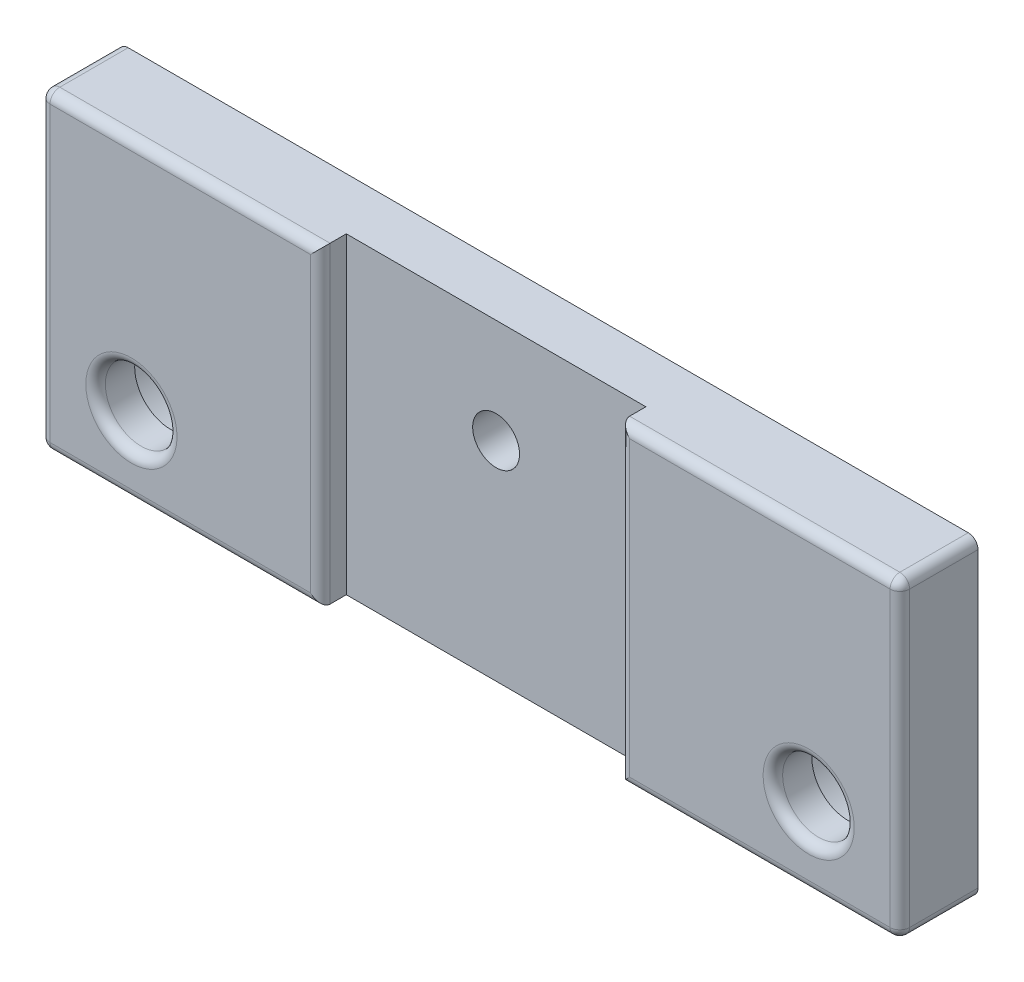
ISO-10303-21;
HEADER;
FILE_DESCRIPTION(('STEP AP214'),'2;1');
FILE_NAME('part.step','',(''),(''),'','','');
FILE_SCHEMA(('AUTOMOTIVE_DESIGN { 1 0 10303 214 1 1 1 1 }'));
ENDSEC;
DATA;
#1=APPLICATION_CONTEXT('core data for automotive mechanical design processes');
#2=APPLICATION_PROTOCOL_DEFINITION('international standard','automotive_design',2000,#1);
#3=PRODUCT_CONTEXT('',#1,'mechanical');
#4=PRODUCT('Part','Part','',(#3));
#5=PRODUCT_RELATED_PRODUCT_CATEGORY('part','',(#4));
#6=PRODUCT_DEFINITION_FORMATION('','',#4);
#7=PRODUCT_DEFINITION_CONTEXT('part definition',#1,'design');
#8=PRODUCT_DEFINITION('design','',#6,#7);
#9=PRODUCT_DEFINITION_SHAPE('','',#8);
#10=(LENGTH_UNIT() NAMED_UNIT(*) SI_UNIT(.MILLI.,.METRE.));
#11=(NAMED_UNIT(*) PLANE_ANGLE_UNIT() SI_UNIT($,.RADIAN.));
#12=(NAMED_UNIT(*) SI_UNIT($,.STERADIAN.) SOLID_ANGLE_UNIT());
#13=UNCERTAINTY_MEASURE_WITH_UNIT(LENGTH_MEASURE(1.E-05),#10,'distance_accuracy_value','');
#14=(GEOMETRIC_REPRESENTATION_CONTEXT(3) GLOBAL_UNCERTAINTY_ASSIGNED_CONTEXT((#13)) GLOBAL_UNIT_ASSIGNED_CONTEXT((#10,
#11,#12)) REPRESENTATION_CONTEXT('',''));
#15=CARTESIAN_POINT('',(0.,0.,0.));
#16=DIRECTION('',(0.,0.,1.));
#17=DIRECTION('',(1.,0.,0.));
#18=AXIS2_PLACEMENT_3D('',#15,#16,#17);
#19=CARTESIAN_POINT('',(7.,6.,6.));
#20=DIRECTION('',(0.,0.,-1.));
#21=DIRECTION('',(-1.,0.,0.));
#22=AXIS2_PLACEMENT_3D('',#19,#20,#21);
#23=CYLINDRICAL_SURFACE('',#22,2.75);
#24=CARTESIAN_POINT('',(7.,6.,5.25));
#25=DIRECTION('',(0.,0.,-1.));
#26=DIRECTION('',(-1.,0.,0.));
#27=AXIS2_PLACEMENT_3D('',#24,#25,#26);
#28=CIRCLE('',#27,2.75);
#29=CARTESIAN_POINT('',(4.25,6.,5.25));
#30=VERTEX_POINT('',#29);
#31=EDGE_CURVE('E265',#30,#30,#28,.F.);
#32=ORIENTED_EDGE('',*,*,#31,.T.);
#33=EDGE_LOOP('',(#32));
#34=FACE_BOUND('',#33,.T.);
#35=CARTESIAN_POINT('',(7.,6.,3.));
#36=DIRECTION('',(0.,0.,-1.));
#37=DIRECTION('',(-1.,0.,0.));
#38=AXIS2_PLACEMENT_3D('',#35,#36,#37);
#39=CIRCLE('',#38,2.75);
#40=CARTESIAN_POINT('',(4.25,6.,3.));
#41=VERTEX_POINT('',#40);
#42=EDGE_CURVE('E203',#41,#41,#39,.F.);
#43=ORIENTED_EDGE('',*,*,#42,.F.);
#44=EDGE_LOOP('',(#43));
#45=FACE_BOUND('',#44,.T.);
#46=ADVANCED_FACE('F33',(#34,#45),#23,.F.);
#47=CARTESIAN_POINT('',(59.,6.,6.));
#48=DIRECTION('',(0.,0.,-1.));
#49=DIRECTION('',(-1.,0.,0.));
#50=AXIS2_PLACEMENT_3D('',#47,#48,#49);
#51=CYLINDRICAL_SURFACE('',#50,2.75);
#52=CARTESIAN_POINT('',(59.,6.,5.25));
#53=DIRECTION('',(0.,0.,-1.));
#54=DIRECTION('',(-1.,0.,0.));
#55=AXIS2_PLACEMENT_3D('',#52,#53,#54);
#56=CIRCLE('',#55,2.75);
#57=CARTESIAN_POINT('',(56.25,6.,5.25));
#58=VERTEX_POINT('',#57);
#59=EDGE_CURVE('E244',#58,#58,#56,.F.);
#60=ORIENTED_EDGE('',*,*,#59,.T.);
#61=EDGE_LOOP('',(#60));
#62=FACE_BOUND('',#61,.T.);
#63=CARTESIAN_POINT('',(59.,6.,3.));
#64=DIRECTION('',(0.,0.,-1.));
#65=DIRECTION('',(-1.,0.,0.));
#66=AXIS2_PLACEMENT_3D('',#63,#64,#65);
#67=CIRCLE('',#66,2.75);
#68=CARTESIAN_POINT('',(56.25,6.,3.));
#69=VERTEX_POINT('',#68);
#70=EDGE_CURVE('E200',#69,#69,#67,.F.);
#71=ORIENTED_EDGE('',*,*,#70,.F.);
#72=EDGE_LOOP('',(#71));
#73=FACE_BOUND('',#72,.T.);
#74=ADVANCED_FACE('F396',(#62,#73),#51,.F.);
#75=CARTESIAN_POINT('',(0.,0.,6.));
#76=DIRECTION('',(0.,0.,-1.));
#77=DIRECTION('',(-1.,0.,0.));
#78=AXIS2_PLACEMENT_3D('',#75,#76,#77);
#79=PLANE('',#78);
#80=DIRECTION('',(-1.,0.,0.));
#81=VECTOR('',#80,1.);
#82=CARTESIAN_POINT('',(0.,23.25,6.));
#83=LINE('',#82,#81);
#84=CARTESIAN_POINT('',(20.75,23.25,6.));
#85=VERTEX_POINT('',#84);
#86=CARTESIAN_POINT('',(0.75,23.25,6.));
#87=VERTEX_POINT('',#86);
#88=EDGE_CURVE('E254',#85,#87,#83,.T.);
#89=ORIENTED_EDGE('',*,*,#88,.T.);
#90=DIRECTION('',(0.,-1.,0.));
#91=VECTOR('',#90,1.);
#92=CARTESIAN_POINT('',(0.75,0.,6.));
#93=LINE('',#92,#91);
#94=CARTESIAN_POINT('',(0.75,0.75,6.));
#95=VERTEX_POINT('',#94);
#96=EDGE_CURVE('E256',#87,#95,#93,.T.);
#97=ORIENTED_EDGE('',*,*,#96,.T.);
#98=DIRECTION('',(1.,0.,0.));
#99=VECTOR('',#98,1.);
#100=CARTESIAN_POINT('',(0.,0.75,6.));
#101=LINE('',#100,#99);
#102=CARTESIAN_POINT('',(20.75,0.75,6.));
#103=VERTEX_POINT('',#102);
#104=EDGE_CURVE('E250',#95,#103,#101,.T.);
#105=ORIENTED_EDGE('',*,*,#104,.T.);
#106=DIRECTION('',(0.,-1.,0.));
#107=VECTOR('',#106,1.);
#108=CARTESIAN_POINT('',(20.75,0.,6.));
#109=LINE('',#108,#107);
#110=EDGE_CURVE('E252',#103,#85,#109,.F.);
#111=ORIENTED_EDGE('',*,*,#110,.T.);
#112=EDGE_LOOP('',(#89,#97,#105,#111));
#113=FACE_BOUND('',#112,.T.);
#114=CARTESIAN_POINT('',(7.,6.,6.));
#115=DIRECTION('',(0.,0.,-1.));
#116=DIRECTION('',(-1.,0.,0.));
#117=AXIS2_PLACEMENT_3D('',#114,#115,#116);
#118=CIRCLE('',#117,3.5);
#119=CARTESIAN_POINT('',(3.5,6.,6.));
#120=VERTEX_POINT('',#119);
#121=EDGE_CURVE('E247',#120,#120,#118,.T.);
#122=ORIENTED_EDGE('',*,*,#121,.T.);
#123=EDGE_LOOP('',(#122));
#124=FACE_BOUND('',#123,.T.);
#125=ADVANCED_FACE('F402',(#113,#124),#79,.F.);
#126=CARTESIAN_POINT('',(0.,0.,6.));
#127=DIRECTION('',(1.,0.,0.));
#128=DIRECTION('',(0.,0.,-1.));
#129=AXIS2_PLACEMENT_3D('',#126,#127,#128);
#130=PLANE('',#129);
#131=DIRECTION('',(0.,-1.,0.));
#132=VECTOR('',#131,1.);
#133=CARTESIAN_POINT('',(0.,0.,5.25));
#134=LINE('',#133,#132);
#135=CARTESIAN_POINT('',(0.,0.75,5.25));
#136=VERTEX_POINT('',#135);
#137=CARTESIAN_POINT('',(0.,23.25,5.25));
#138=VERTEX_POINT('',#137);
#139=EDGE_CURVE('E260',#136,#138,#134,.F.);
#140=ORIENTED_EDGE('',*,*,#139,.T.);
#141=DIRECTION('',(0.,0.,-1.));
#142=VECTOR('',#141,1.);
#143=CARTESIAN_POINT('',(0.,23.25,6.));
#144=LINE('',#143,#142);
#145=CARTESIAN_POINT('',(0.,23.25,0.));
#146=VERTEX_POINT('',#145);
#147=EDGE_CURVE('E262',#138,#146,#144,.T.);
#148=ORIENTED_EDGE('',*,*,#147,.T.);
#149=DIRECTION('',(0.,-1.,0.));
#150=VECTOR('',#149,1.);
#151=CARTESIAN_POINT('',(0.,0.,0.));
#152=LINE('',#151,#150);
#153=CARTESIAN_POINT('',(0.,0.75,0.));
#154=VERTEX_POINT('',#153);
#155=EDGE_CURVE('E184',#146,#154,#152,.T.);
#156=ORIENTED_EDGE('',*,*,#155,.T.);
#157=DIRECTION('',(0.,0.,-1.));
#158=VECTOR('',#157,1.);
#159=CARTESIAN_POINT('',(0.,0.75,6.));
#160=LINE('',#159,#158);
#161=EDGE_CURVE('E58',#154,#136,#160,.F.);
#162=ORIENTED_EDGE('',*,*,#161,.T.);
#163=EDGE_LOOP('',(#140,#148,#156,#162));
#164=FACE_BOUND('',#163,.T.);
#165=ADVANCED_FACE('F336',(#164),#130,.F.);
#166=CARTESIAN_POINT('',(0.,0.,6.));
#167=DIRECTION('',(0.,1.,0.));
#168=DIRECTION('',(0.,0.,1.));
#169=AXIS2_PLACEMENT_3D('',#166,#167,#168);
#170=PLANE('',#169);
#171=DIRECTION('',(0.,0.,1.));
#172=VECTOR('',#171,1.);
#173=CARTESIAN_POINT('',(21.5,0.,4.));
#174=LINE('',#173,#172);
#175=CARTESIAN_POINT('',(21.5,0.,4.));
#176=VERTEX_POINT('',#175);
#177=CARTESIAN_POINT('',(21.5,0.,5.25));
#178=VERTEX_POINT('',#177);
#179=EDGE_CURVE('E150',#176,#178,#174,.T.);
#180=ORIENTED_EDGE('',*,*,#179,.T.);
#181=DIRECTION('',(1.,0.,0.));
#182=VECTOR('',#181,1.);
#183=CARTESIAN_POINT('',(0.,0.,5.25));
#184=LINE('',#183,#182);
#185=CARTESIAN_POINT('',(0.75,0.,5.25));
#186=VERTEX_POINT('',#185);
#187=EDGE_CURVE('E232',#178,#186,#184,.F.);
#188=ORIENTED_EDGE('',*,*,#187,.T.);
#189=DIRECTION('',(0.,0.,-1.));
#190=VECTOR('',#189,1.);
#191=CARTESIAN_POINT('',(0.75,0.,6.));
#192=LINE('',#191,#190);
#193=CARTESIAN_POINT('',(0.75,0.,0.));
#194=VERTEX_POINT('',#193);
#195=EDGE_CURVE('E230',#186,#194,#192,.T.);
#196=ORIENTED_EDGE('',*,*,#195,.T.);
#197=DIRECTION('',(1.,0.,0.));
#198=VECTOR('',#197,1.);
#199=CARTESIAN_POINT('',(0.,0.,0.));
#200=LINE('',#199,#198);
#201=CARTESIAN_POINT('',(65.25,0.,0.));
#202=VERTEX_POINT('',#201);
#203=EDGE_CURVE('E190',#194,#202,#200,.T.);
#204=ORIENTED_EDGE('',*,*,#203,.T.);
#205=DIRECTION('',(0.,0.,-1.));
#206=VECTOR('',#205,1.);
#207=CARTESIAN_POINT('',(65.25,0.,6.));
#208=LINE('',#207,#206);
#209=CARTESIAN_POINT('',(65.25,0.,5.25));
#210=VERTEX_POINT('',#209);
#211=EDGE_CURVE('E226',#202,#210,#208,.F.);
#212=ORIENTED_EDGE('',*,*,#211,.T.);
#213=DIRECTION('',(1.,0.,0.));
#214=VECTOR('',#213,1.);
#215=CARTESIAN_POINT('',(0.,0.,5.25));
#216=LINE('',#215,#214);
#217=CARTESIAN_POINT('',(44.5,0.,5.25));
#218=VERTEX_POINT('',#217);
#219=EDGE_CURVE('E228',#210,#218,#216,.F.);
#220=ORIENTED_EDGE('',*,*,#219,.T.);
#221=DIRECTION('',(0.,0.,1.));
#222=VECTOR('',#221,1.);
#223=CARTESIAN_POINT('',(44.5,0.,4.));
#224=LINE('',#223,#222);
#225=CARTESIAN_POINT('',(44.5,0.,4.));
#226=VERTEX_POINT('',#225);
#227=EDGE_CURVE('E161',#226,#218,#224,.T.);
#228=ORIENTED_EDGE('',*,*,#227,.F.);
#229=DIRECTION('',(1.,0.,0.));
#230=VECTOR('',#229,1.);
#231=CARTESIAN_POINT('',(21.5,0.,4.));
#232=LINE('',#231,#230);
#233=EDGE_CURVE('E168',#176,#226,#232,.T.);
#234=ORIENTED_EDGE('',*,*,#233,.F.);
#235=EDGE_LOOP('',(#180,#188,#196,#204,#212,#220,#228,#234));
#236=FACE_BOUND('',#235,.T.);
#237=ADVANCED_FACE('F174',(#236),#170,.F.);
#238=CARTESIAN_POINT('',(66.,0.,6.));
#239=DIRECTION('',(-1.,0.,0.));
#240=DIRECTION('',(0.,0.,1.));
#241=AXIS2_PLACEMENT_3D('',#238,#239,#240);
#242=PLANE('',#241);
#243=DIRECTION('',(0.,1.,0.));
#244=VECTOR('',#243,1.);
#245=CARTESIAN_POINT('',(66.,0.,5.25));
#246=LINE('',#245,#244);
#247=CARTESIAN_POINT('',(66.,23.25,5.25));
#248=VERTEX_POINT('',#247);
#249=CARTESIAN_POINT('',(66.,0.75,5.25));
#250=VERTEX_POINT('',#249);
#251=EDGE_CURVE('E221',#248,#250,#246,.F.);
#252=ORIENTED_EDGE('',*,*,#251,.T.);
#253=DIRECTION('',(0.,0.,-1.));
#254=VECTOR('',#253,1.);
#255=CARTESIAN_POINT('',(66.,0.75,6.));
#256=LINE('',#255,#254);
#257=CARTESIAN_POINT('',(66.,0.75,0.));
#258=VERTEX_POINT('',#257);
#259=EDGE_CURVE('E224',#250,#258,#256,.T.);
#260=ORIENTED_EDGE('',*,*,#259,.T.);
#261=DIRECTION('',(0.,1.,0.));
#262=VECTOR('',#261,1.);
#263=CARTESIAN_POINT('',(66.,0.,0.));
#264=LINE('',#263,#262);
#265=CARTESIAN_POINT('',(66.,23.25,0.));
#266=VERTEX_POINT('',#265);
#267=EDGE_CURVE('E193',#258,#266,#264,.T.);
#268=ORIENTED_EDGE('',*,*,#267,.T.);
#269=DIRECTION('',(0.,0.,-1.));
#270=VECTOR('',#269,1.);
#271=CARTESIAN_POINT('',(66.,23.25,6.));
#272=LINE('',#271,#270);
#273=EDGE_CURVE('E219',#266,#248,#272,.F.);
#274=ORIENTED_EDGE('',*,*,#273,.T.);
#275=EDGE_LOOP('',(#252,#260,#268,#274));
#276=FACE_BOUND('',#275,.T.);
#277=ADVANCED_FACE('F364',(#276),#242,.F.);
#278=CARTESIAN_POINT('',(0.,24.,6.));
#279=DIRECTION('',(0.,-1.,0.));
#280=DIRECTION('',(0.,0.,-1.));
#281=AXIS2_PLACEMENT_3D('',#278,#279,#280);
#282=PLANE('',#281);
#283=DIRECTION('',(0.,0.,-1.));
#284=VECTOR('',#283,1.);
#285=CARTESIAN_POINT('',(0.75,24.,6.));
#286=LINE('',#285,#284);
#287=CARTESIAN_POINT('',(0.75,24.,0.));
#288=VERTEX_POINT('',#287);
#289=CARTESIAN_POINT('',(0.75,24.,5.25));
#290=VERTEX_POINT('',#289);
#291=EDGE_CURVE('E240',#288,#290,#286,.F.);
#292=ORIENTED_EDGE('',*,*,#291,.T.);
#293=DIRECTION('',(-1.,0.,0.));
#294=VECTOR('',#293,1.);
#295=CARTESIAN_POINT('',(0.,24.,5.25));
#296=LINE('',#295,#294);
#297=CARTESIAN_POINT('',(21.5,24.,5.25));
#298=VERTEX_POINT('',#297);
#299=EDGE_CURVE('E242',#290,#298,#296,.F.);
#300=ORIENTED_EDGE('',*,*,#299,.T.);
#301=DIRECTION('',(0.,0.,1.));
#302=VECTOR('',#301,1.);
#303=CARTESIAN_POINT('',(21.5,24.,4.));
#304=LINE('',#303,#302);
#305=CARTESIAN_POINT('',(21.5,24.,4.));
#306=VERTEX_POINT('',#305);
#307=EDGE_CURVE('E182',#306,#298,#304,.T.);
#308=ORIENTED_EDGE('',*,*,#307,.F.);
#309=DIRECTION('',(-1.,0.,0.));
#310=VECTOR('',#309,1.);
#311=CARTESIAN_POINT('',(21.5,24.,4.));
#312=LINE('',#311,#310);
#313=CARTESIAN_POINT('',(44.5,24.,4.));
#314=VERTEX_POINT('',#313);
#315=EDGE_CURVE('E162',#314,#306,#312,.T.);
#316=ORIENTED_EDGE('',*,*,#315,.F.);
#317=DIRECTION('',(0.,0.,1.));
#318=VECTOR('',#317,1.);
#319=CARTESIAN_POINT('',(44.5,24.,4.));
#320=LINE('',#319,#318);
#321=CARTESIAN_POINT('',(44.5,24.,5.25));
#322=VERTEX_POINT('',#321);
#323=EDGE_CURVE('E185',#314,#322,#320,.T.);
#324=ORIENTED_EDGE('',*,*,#323,.T.);
#325=DIRECTION('',(-1.,0.,0.));
#326=VECTOR('',#325,1.);
#327=CARTESIAN_POINT('',(0.,24.,5.25));
#328=LINE('',#327,#326);
#329=CARTESIAN_POINT('',(65.25,24.,5.25));
#330=VERTEX_POINT('',#329);
#331=EDGE_CURVE('E238',#322,#330,#328,.F.);
#332=ORIENTED_EDGE('',*,*,#331,.T.);
#333=DIRECTION('',(0.,0.,-1.));
#334=VECTOR('',#333,1.);
#335=CARTESIAN_POINT('',(65.25,24.,6.));
#336=LINE('',#335,#334);
#337=CARTESIAN_POINT('',(65.25,24.,0.));
#338=VERTEX_POINT('',#337);
#339=EDGE_CURVE('E236',#330,#338,#336,.T.);
#340=ORIENTED_EDGE('',*,*,#339,.T.);
#341=DIRECTION('',(-1.,0.,0.));
#342=VECTOR('',#341,1.);
#343=CARTESIAN_POINT('',(0.,24.,0.));
#344=LINE('',#343,#342);
#345=EDGE_CURVE('E196',#338,#288,#344,.T.);
#346=ORIENTED_EDGE('',*,*,#345,.T.);
#347=EDGE_LOOP('',(#292,#300,#308,#316,#324,#332,#340,#346));
#348=FACE_BOUND('',#347,.T.);
#349=ADVANCED_FACE('F344',(#348),#282,.F.);
#350=DIRECTION('',(1.,0.,0.));
#351=VECTOR('',#350,1.);
#352=CARTESIAN_POINT('',(0.,0.75,6.));
#353=LINE('',#352,#351);
#354=CARTESIAN_POINT('',(45.25,0.75,6.));
#355=VERTEX_POINT('',#354);
#356=CARTESIAN_POINT('',(65.25,0.75,6.));
#357=VERTEX_POINT('',#356);
#358=EDGE_CURVE('E214',#355,#357,#353,.T.);
#359=ORIENTED_EDGE('',*,*,#358,.T.);
#360=DIRECTION('',(0.,1.,0.));
#361=VECTOR('',#360,1.);
#362=CARTESIAN_POINT('',(65.25,0.,6.));
#363=LINE('',#362,#361);
#364=CARTESIAN_POINT('',(65.25,23.25,6.));
#365=VERTEX_POINT('',#364);
#366=EDGE_CURVE('E216',#357,#365,#363,.T.);
#367=ORIENTED_EDGE('',*,*,#366,.T.);
#368=DIRECTION('',(-1.,0.,0.));
#369=VECTOR('',#368,1.);
#370=CARTESIAN_POINT('',(0.,23.25,6.));
#371=LINE('',#370,#369);
#372=CARTESIAN_POINT('',(45.25,23.25,6.));
#373=VERTEX_POINT('',#372);
#374=EDGE_CURVE('E210',#365,#373,#371,.T.);
#375=ORIENTED_EDGE('',*,*,#374,.T.);
#376=DIRECTION('',(0.,1.,0.));
#377=VECTOR('',#376,1.);
#378=CARTESIAN_POINT('',(45.25,0.,6.));
#379=LINE('',#378,#377);
#380=EDGE_CURVE('E212',#373,#355,#379,.F.);
#381=ORIENTED_EDGE('',*,*,#380,.T.);
#382=EDGE_LOOP('',(#359,#367,#375,#381));
#383=FACE_BOUND('',#382,.T.);
#384=CARTESIAN_POINT('',(59.,6.,6.));
#385=DIRECTION('',(0.,0.,-1.));
#386=DIRECTION('',(-1.,0.,0.));
#387=AXIS2_PLACEMENT_3D('',#384,#385,#386);
#388=CIRCLE('',#387,3.5);
#389=CARTESIAN_POINT('',(55.5,6.,6.));
#390=VERTEX_POINT('',#389);
#391=EDGE_CURVE('E199',#390,#390,#388,.T.);
#392=ORIENTED_EDGE('',*,*,#391,.T.);
#393=EDGE_LOOP('',(#392));
#394=FACE_BOUND('',#393,.T.);
#395=ADVANCED_FACE('F444',(#383,#394),#79,.F.);
#396=CARTESIAN_POINT('',(0.,0.,0.));
#397=DIRECTION('',(0.,0.,-1.));
#398=DIRECTION('',(-1.,0.,0.));
#399=AXIS2_PLACEMENT_3D('',#396,#397,#398);
#400=PLANE('',#399);
#401=CARTESIAN_POINT('',(59.,6.,0.));
#402=DIRECTION('',(0.,0.,-1.));
#403=DIRECTION('',(-1.,0.,0.));
#404=AXIS2_PLACEMENT_3D('',#401,#402,#403);
#405=CIRCLE('',#404,5.1);
#406=CARTESIAN_POINT('',(53.9,6.,0.));
#407=VERTEX_POINT('',#406);
#408=EDGE_CURVE('E429',#407,#407,#405,.T.);
#409=ORIENTED_EDGE('',*,*,#408,.F.);
#410=EDGE_LOOP('',(#409));
#411=FACE_BOUND('',#410,.T.);
#412=CARTESIAN_POINT('',(7.,6.,0.));
#413=DIRECTION('',(0.,0.,-1.));
#414=DIRECTION('',(-1.,0.,0.));
#415=AXIS2_PLACEMENT_3D('',#412,#413,#414);
#416=CIRCLE('',#415,5.1);
#417=CARTESIAN_POINT('',(1.9,6.,0.));
#418=VERTEX_POINT('',#417);
#419=EDGE_CURVE('E295',#418,#418,#416,.T.);
#420=ORIENTED_EDGE('',*,*,#419,.F.);
#421=EDGE_LOOP('',(#420));
#422=FACE_BOUND('',#421,.T.);
#423=CARTESIAN_POINT('',(33.,16.,0.));
#424=DIRECTION('',(0.,0.,1.));
#425=DIRECTION('',(1.,0.,0.));
#426=AXIS2_PLACEMENT_3D('',#423,#424,#425);
#427=CIRCLE('',#426,1.8);
#428=CARTESIAN_POINT('',(34.8,16.,0.));
#429=VERTEX_POINT('',#428);
#430=EDGE_CURVE('E172',#429,#429,#427,.T.);
#431=ORIENTED_EDGE('',*,*,#430,.T.);
#432=EDGE_LOOP('',(#431));
#433=FACE_BOUND('',#432,.T.);
#434=ORIENTED_EDGE('',*,*,#155,.F.);
#435=CARTESIAN_POINT('',(0.75,23.25,0.));
#436=DIRECTION('',(0.,0.,-1.));
#437=DIRECTION('',(-1.,0.,0.));
#438=AXIS2_PLACEMENT_3D('',#435,#436,#437);
#439=CIRCLE('',#438,0.75);
#440=EDGE_CURVE('E11',#146,#288,#439,.T.);
#441=ORIENTED_EDGE('',*,*,#440,.T.);
#442=ORIENTED_EDGE('',*,*,#345,.F.);
#443=CARTESIAN_POINT('',(65.25,23.25,0.));
#444=DIRECTION('',(0.,0.,-1.));
#445=DIRECTION('',(-1.,0.,0.));
#446=AXIS2_PLACEMENT_3D('',#443,#444,#445);
#447=CIRCLE('',#446,0.75);
#448=EDGE_CURVE('E268',#338,#266,#447,.T.);
#449=ORIENTED_EDGE('',*,*,#448,.T.);
#450=ORIENTED_EDGE('',*,*,#267,.F.);
#451=CARTESIAN_POINT('',(65.25,0.75,0.));
#452=DIRECTION('',(0.,0.,-1.));
#453=DIRECTION('',(-1.,0.,0.));
#454=AXIS2_PLACEMENT_3D('',#451,#452,#453);
#455=CIRCLE('',#454,0.75);
#456=EDGE_CURVE('E270',#258,#202,#455,.T.);
#457=ORIENTED_EDGE('',*,*,#456,.T.);
#458=ORIENTED_EDGE('',*,*,#203,.F.);
#459=CARTESIAN_POINT('',(0.75,0.75,0.));
#460=DIRECTION('',(0.,0.,-1.));
#461=DIRECTION('',(-1.,0.,0.));
#462=AXIS2_PLACEMENT_3D('',#459,#460,#461);
#463=CIRCLE('',#462,0.75);
#464=EDGE_CURVE('E42',#194,#154,#463,.T.);
#465=ORIENTED_EDGE('',*,*,#464,.T.);
#466=EDGE_LOOP('',(#434,#441,#442,#449,#450,#457,#458,#465));
#467=FACE_BOUND('',#466,.T.);
#468=ADVANCED_FACE('F334',(#411,#422,#433,#467),#400,.T.);
#469=CARTESIAN_POINT('',(21.5,0.,4.));
#470=DIRECTION('',(-1.,0.,0.));
#471=DIRECTION('',(0.,0.,1.));
#472=AXIS2_PLACEMENT_3D('',#469,#470,#471);
#473=PLANE('',#472);
#474=ORIENTED_EDGE('',*,*,#307,.T.);
#475=DIRECTION('',(0.,-1.,0.));
#476=VECTOR('',#475,1.);
#477=CARTESIAN_POINT('',(21.5,0.,5.25));
#478=LINE('',#477,#476);
#479=EDGE_CURVE('E157',#298,#178,#478,.T.);
#480=ORIENTED_EDGE('',*,*,#479,.T.);
#481=ORIENTED_EDGE('',*,*,#179,.F.);
#482=DIRECTION('',(0.,-1.,0.));
#483=VECTOR('',#482,1.);
#484=CARTESIAN_POINT('',(21.5,0.,4.));
#485=LINE('',#484,#483);
#486=EDGE_CURVE('E154',#306,#176,#485,.T.);
#487=ORIENTED_EDGE('',*,*,#486,.F.);
#488=EDGE_LOOP('',(#474,#480,#481,#487));
#489=FACE_BOUND('',#488,.T.);
#490=ADVANCED_FACE('F153',(#489),#473,.F.);
#491=CARTESIAN_POINT('',(44.5,0.,4.));
#492=DIRECTION('',(1.,0.,0.));
#493=DIRECTION('',(0.,0.,-1.));
#494=AXIS2_PLACEMENT_3D('',#491,#492,#493);
#495=PLANE('',#494);
#496=ORIENTED_EDGE('',*,*,#227,.T.);
#497=DIRECTION('',(0.,1.,0.));
#498=VECTOR('',#497,1.);
#499=CARTESIAN_POINT('',(44.5,0.,5.25));
#500=LINE('',#499,#498);
#501=EDGE_CURVE('E234',#218,#322,#500,.T.);
#502=ORIENTED_EDGE('',*,*,#501,.T.);
#503=ORIENTED_EDGE('',*,*,#323,.F.);
#504=DIRECTION('',(0.,1.,0.));
#505=VECTOR('',#504,1.);
#506=CARTESIAN_POINT('',(44.5,0.,4.));
#507=LINE('',#506,#505);
#508=EDGE_CURVE('E176',#226,#314,#507,.T.);
#509=ORIENTED_EDGE('',*,*,#508,.F.);
#510=EDGE_LOOP('',(#496,#502,#503,#509));
#511=FACE_BOUND('',#510,.T.);
#512=ADVANCED_FACE('F384',(#511),#495,.F.);
#513=CARTESIAN_POINT('',(0.,0.,4.));
#514=DIRECTION('',(0.,0.,-1.));
#515=DIRECTION('',(-1.,0.,0.));
#516=AXIS2_PLACEMENT_3D('',#513,#514,#515);
#517=PLANE('',#516);
#518=CARTESIAN_POINT('',(33.,16.,4.));
#519=DIRECTION('',(0.,0.,1.));
#520=DIRECTION('',(1.,0.,0.));
#521=AXIS2_PLACEMENT_3D('',#518,#519,#520);
#522=CIRCLE('',#521,1.8);
#523=CARTESIAN_POINT('',(34.8,16.,4.));
#524=VERTEX_POINT('',#523);
#525=EDGE_CURVE('E207',#524,#524,#522,.T.);
#526=ORIENTED_EDGE('',*,*,#525,.F.);
#527=EDGE_LOOP('',(#526));
#528=FACE_BOUND('',#527,.T.);
#529=ORIENTED_EDGE('',*,*,#486,.T.);
#530=ORIENTED_EDGE('',*,*,#233,.T.);
#531=ORIENTED_EDGE('',*,*,#508,.T.);
#532=ORIENTED_EDGE('',*,*,#315,.T.);
#533=EDGE_LOOP('',(#529,#530,#531,#532));
#534=FACE_BOUND('',#533,.T.);
#535=ADVANCED_FACE('F166',(#528,#534),#517,.F.);
#536=CARTESIAN_POINT('',(33.,16.,0.));
#537=DIRECTION('',(0.,0.,1.));
#538=DIRECTION('',(1.,0.,0.));
#539=AXIS2_PLACEMENT_3D('',#536,#537,#538);
#540=CYLINDRICAL_SURFACE('',#539,1.8);
#541=ORIENTED_EDGE('',*,*,#430,.F.);
#542=EDGE_LOOP('',(#541));
#543=FACE_BOUND('',#542,.T.);
#544=ORIENTED_EDGE('',*,*,#525,.T.);
#545=EDGE_LOOP('',(#544));
#546=FACE_BOUND('',#545,.T.);
#547=ADVANCED_FACE('F391',(#543,#546),#540,.F.);
#548=CARTESIAN_POINT('',(59.,6.,3.));
#549=DIRECTION('',(0.,0.,-1.));
#550=DIRECTION('',(-1.,0.,0.));
#551=AXIS2_PLACEMENT_3D('',#548,#549,#550);
#552=PLANE('',#551);
#553=CARTESIAN_POINT('',(59.,6.,3.));
#554=DIRECTION('',(0.,0.,-1.));
#555=DIRECTION('',(-1.,0.,0.));
#556=AXIS2_PLACEMENT_3D('',#553,#554,#555);
#557=CIRCLE('',#556,5.1);
#558=CARTESIAN_POINT('',(53.9,6.,3.));
#559=VERTEX_POINT('',#558);
#560=EDGE_CURVE('E204',#559,#559,#557,.T.);
#561=ORIENTED_EDGE('',*,*,#560,.T.);
#562=EDGE_LOOP('',(#561));
#563=FACE_BOUND('',#562,.T.);
#564=ORIENTED_EDGE('',*,*,#70,.T.);
#565=EDGE_LOOP('',(#564));
#566=FACE_BOUND('',#565,.T.);
#567=ADVANCED_FACE('F409',(#563,#566),#552,.T.);
#568=CARTESIAN_POINT('',(59.,6.,3.));
#569=DIRECTION('',(0.,0.,-1.));
#570=DIRECTION('',(-1.,0.,0.));
#571=AXIS2_PLACEMENT_3D('',#568,#569,#570);
#572=CYLINDRICAL_SURFACE('',#571,5.1);
#573=ORIENTED_EDGE('',*,*,#560,.F.);
#574=EDGE_LOOP('',(#573));
#575=FACE_BOUND('',#574,.T.);
#576=ORIENTED_EDGE('',*,*,#408,.T.);
#577=EDGE_LOOP('',(#576));
#578=FACE_BOUND('',#577,.T.);
#579=ADVANCED_FACE('F414',(#575,#578),#572,.F.);
#580=CARTESIAN_POINT('',(7.,6.,3.));
#581=DIRECTION('',(0.,0.,-1.));
#582=DIRECTION('',(-1.,0.,0.));
#583=AXIS2_PLACEMENT_3D('',#580,#581,#582);
#584=PLANE('',#583);
#585=CARTESIAN_POINT('',(7.,6.,3.));
#586=DIRECTION('',(0.,0.,-1.));
#587=DIRECTION('',(-1.,0.,0.));
#588=AXIS2_PLACEMENT_3D('',#585,#586,#587);
#589=CIRCLE('',#588,5.1);
#590=CARTESIAN_POINT('',(1.9,6.,3.));
#591=VERTEX_POINT('',#590);
#592=EDGE_CURVE('E426',#591,#591,#589,.T.);
#593=ORIENTED_EDGE('',*,*,#592,.T.);
#594=EDGE_LOOP('',(#593));
#595=FACE_BOUND('',#594,.T.);
#596=ORIENTED_EDGE('',*,*,#42,.T.);
#597=EDGE_LOOP('',(#596));
#598=FACE_BOUND('',#597,.T.);
#599=ADVANCED_FACE('F438',(#595,#598),#584,.T.);
#600=CARTESIAN_POINT('',(7.,6.,3.));
#601=DIRECTION('',(0.,0.,-1.));
#602=DIRECTION('',(-1.,0.,0.));
#603=AXIS2_PLACEMENT_3D('',#600,#601,#602);
#604=CYLINDRICAL_SURFACE('',#603,5.1);
#605=ORIENTED_EDGE('',*,*,#592,.F.);
#606=EDGE_LOOP('',(#605));
#607=FACE_BOUND('',#606,.T.);
#608=ORIENTED_EDGE('',*,*,#419,.T.);
#609=EDGE_LOOP('',(#608));
#610=FACE_BOUND('',#609,.T.);
#611=ADVANCED_FACE('F449',(#607,#610),#604,.F.);
#612=CARTESIAN_POINT('',(45.25,0.,5.25));
#613=DIRECTION('',(0.,1.,0.));
#614=DIRECTION('',(0.,0.,1.));
#615=AXIS2_PLACEMENT_3D('',#612,#613,#614);
#616=CYLINDRICAL_SURFACE('',#615,0.75);
#617=CARTESIAN_POINT('',(45.25,23.25,5.25));
#618=DIRECTION('',(-0.707106781186547,-0.707106781186547,0.));
#619=DIRECTION('',(-0.707106781186547,0.707106781186547,0.));
#620=AXIS2_PLACEMENT_3D('',#617,#618,#619);
#621=ELLIPSE('',#620,1.06066017177982,0.75);
#622=EDGE_CURVE('E289',#322,#373,#621,.F.);
#623=ORIENTED_EDGE('',*,*,#622,.F.);
#624=ORIENTED_EDGE('',*,*,#501,.F.);
#625=CARTESIAN_POINT('',(45.25,0.75,5.25));
#626=DIRECTION('',(-0.707106781186547,0.707106781186547,0.));
#627=DIRECTION('',(0.707106781186547,0.707106781186547,0.));
#628=AXIS2_PLACEMENT_3D('',#625,#626,#627);
#629=ELLIPSE('',#628,1.06066017177982,0.75);
#630=EDGE_CURVE('E292',#355,#218,#629,.F.);
#631=ORIENTED_EDGE('',*,*,#630,.F.);
#632=ORIENTED_EDGE('',*,*,#380,.F.);
#633=EDGE_LOOP('',(#623,#624,#631,#632));
#634=FACE_BOUND('',#633,.T.);
#635=ADVANCED_FACE('F382',(#634),#616,.T.);
#636=CARTESIAN_POINT('',(65.25,0.75,6.));
#637=DIRECTION('',(0.,0.,-1.));
#638=DIRECTION('',(-1.,0.,0.));
#639=AXIS2_PLACEMENT_3D('',#636,#637,#638);
#640=CYLINDRICAL_SURFACE('',#639,0.75);
#641=ORIENTED_EDGE('',*,*,#456,.F.);
#642=ORIENTED_EDGE('',*,*,#259,.F.);
#643=CARTESIAN_POINT('',(65.25,0.75,5.25));
#644=DIRECTION('',(0.,0.,1.));
#645=DIRECTION('',(1.,0.,0.));
#646=AXIS2_PLACEMENT_3D('',#643,#644,#645);
#647=CIRCLE('',#646,0.75);
#648=EDGE_CURVE('E286',#210,#250,#647,.T.);
#649=ORIENTED_EDGE('',*,*,#648,.F.);
#650=ORIENTED_EDGE('',*,*,#211,.F.);
#651=EDGE_LOOP('',(#641,#642,#649,#650));
#652=FACE_BOUND('',#651,.T.);
#653=ADVANCED_FACE('F370',(#652),#640,.T.);
#654=CARTESIAN_POINT('',(0.,0.75,5.25));
#655=DIRECTION('',(1.,0.,0.));
#656=DIRECTION('',(0.,0.,-1.));
#657=AXIS2_PLACEMENT_3D('',#654,#655,#656);
#658=CYLINDRICAL_SURFACE('',#657,0.75);
#659=ORIENTED_EDGE('',*,*,#630,.T.);
#660=ORIENTED_EDGE('',*,*,#219,.F.);
#661=CARTESIAN_POINT('',(65.25,0.75,5.25));
#662=DIRECTION('',(1.,0.,0.));
#663=DIRECTION('',(0.,0.,-1.));
#664=AXIS2_PLACEMENT_3D('',#661,#662,#663);
#665=CIRCLE('',#664,0.75);
#666=EDGE_CURVE('E283',#357,#210,#665,.T.);
#667=ORIENTED_EDGE('',*,*,#666,.F.);
#668=ORIENTED_EDGE('',*,*,#358,.F.);
#669=EDGE_LOOP('',(#659,#660,#667,#668));
#670=FACE_BOUND('',#669,.T.);
#671=ADVANCED_FACE('F375',(#670),#658,.T.);
#672=CARTESIAN_POINT('',(0.,23.25,5.25));
#673=DIRECTION('',(-1.,0.,0.));
#674=DIRECTION('',(0.,0.,1.));
#675=AXIS2_PLACEMENT_3D('',#672,#673,#674);
#676=CYLINDRICAL_SURFACE('',#675,0.75);
#677=ORIENTED_EDGE('',*,*,#622,.T.);
#678=ORIENTED_EDGE('',*,*,#374,.F.);
#679=CARTESIAN_POINT('',(65.25,23.25,5.25));
#680=DIRECTION('',(1.,0.,0.));
#681=DIRECTION('',(0.,0.,-1.));
#682=AXIS2_PLACEMENT_3D('',#679,#680,#681);
#683=CIRCLE('',#682,0.75);
#684=EDGE_CURVE('E280',#330,#365,#683,.T.);
#685=ORIENTED_EDGE('',*,*,#684,.F.);
#686=ORIENTED_EDGE('',*,*,#331,.F.);
#687=EDGE_LOOP('',(#677,#678,#685,#686));
#688=FACE_BOUND('',#687,.T.);
#689=ADVANCED_FACE('F355',(#688),#676,.T.);
#690=CARTESIAN_POINT('',(65.25,23.25,6.));
#691=DIRECTION('',(0.,0.,-1.));
#692=DIRECTION('',(-1.,0.,0.));
#693=AXIS2_PLACEMENT_3D('',#690,#691,#692);
#694=CYLINDRICAL_SURFACE('',#693,0.75);
#695=ORIENTED_EDGE('',*,*,#448,.F.);
#696=ORIENTED_EDGE('',*,*,#339,.F.);
#697=CARTESIAN_POINT('',(65.25,23.25,5.25));
#698=DIRECTION('',(0.,0.,1.));
#699=DIRECTION('',(1.,0.,0.));
#700=AXIS2_PLACEMENT_3D('',#697,#698,#699);
#701=CIRCLE('',#700,0.75);
#702=EDGE_CURVE('E277',#248,#330,#701,.T.);
#703=ORIENTED_EDGE('',*,*,#702,.F.);
#704=ORIENTED_EDGE('',*,*,#273,.F.);
#705=EDGE_LOOP('',(#695,#696,#703,#704));
#706=FACE_BOUND('',#705,.T.);
#707=ADVANCED_FACE('F350',(#706),#694,.T.);
#708=CARTESIAN_POINT('',(65.25,0.75,5.25));
#709=DIRECTION('',(0.,0.,1.));
#710=DIRECTION('',(1.,0.,0.));
#711=AXIS2_PLACEMENT_3D('',#708,#709,#710);
#712=SPHERICAL_SURFACE('',#711,0.75);
#713=ORIENTED_EDGE('',*,*,#666,.T.);
#714=ORIENTED_EDGE('',*,*,#648,.T.);
#715=CARTESIAN_POINT('',(65.25,0.75,5.25));
#716=DIRECTION('',(0.,-1.,0.));
#717=DIRECTION('',(0.,0.,-1.));
#718=AXIS2_PLACEMENT_3D('',#715,#716,#717);
#719=CIRCLE('',#718,0.75);
#720=EDGE_CURVE('E275',#357,#250,#719,.F.);
#721=ORIENTED_EDGE('',*,*,#720,.F.);
#722=EDGE_LOOP('',(#713,#714,#721));
#723=FACE_BOUND('',#722,.T.);
#724=ADVANCED_FACE('F599',(#723),#712,.T.);
#725=CARTESIAN_POINT('',(65.25,23.25,5.25));
#726=DIRECTION('',(0.,0.,1.));
#727=DIRECTION('',(1.,0.,0.));
#728=AXIS2_PLACEMENT_3D('',#725,#726,#727);
#729=SPHERICAL_SURFACE('',#728,0.75);
#730=ORIENTED_EDGE('',*,*,#702,.T.);
#731=ORIENTED_EDGE('',*,*,#684,.T.);
#732=CARTESIAN_POINT('',(65.25,23.25,5.25));
#733=DIRECTION('',(0.,1.,0.));
#734=DIRECTION('',(0.,0.,1.));
#735=AXIS2_PLACEMENT_3D('',#732,#733,#734);
#736=CIRCLE('',#735,0.75);
#737=EDGE_CURVE('E273',#248,#365,#736,.F.);
#738=ORIENTED_EDGE('',*,*,#737,.F.);
#739=EDGE_LOOP('',(#730,#731,#738));
#740=FACE_BOUND('',#739,.T.);
#741=ADVANCED_FACE('F358',(#740),#729,.T.);
#742=CARTESIAN_POINT('',(65.25,0.,5.25));
#743=DIRECTION('',(0.,1.,0.));
#744=DIRECTION('',(0.,0.,1.));
#745=AXIS2_PLACEMENT_3D('',#742,#743,#744);
#746=CYLINDRICAL_SURFACE('',#745,0.75);
#747=ORIENTED_EDGE('',*,*,#720,.T.);
#748=ORIENTED_EDGE('',*,*,#251,.F.);
#749=ORIENTED_EDGE('',*,*,#737,.T.);
#750=ORIENTED_EDGE('',*,*,#366,.F.);
#751=EDGE_LOOP('',(#747,#748,#749,#750));
#752=FACE_BOUND('',#751,.T.);
#753=ADVANCED_FACE('F361',(#752),#746,.T.);
#754=CARTESIAN_POINT('',(59.,6.,5.25));
#755=DIRECTION('',(0.,0.,-1.));
#756=DIRECTION('',(-1.,0.,0.));
#757=AXIS2_PLACEMENT_3D('',#754,#755,#756);
#758=TOROIDAL_SURFACE('',#757,3.5,0.75);
#759=ORIENTED_EDGE('',*,*,#59,.F.);
#760=EDGE_LOOP('',(#759));
#761=FACE_BOUND('',#760,.T.);
#762=ORIENTED_EDGE('',*,*,#391,.F.);
#763=EDGE_LOOP('',(#762));
#764=FACE_BOUND('',#763,.T.);
#765=ADVANCED_FACE('F622',(#761,#764),#758,.T.);
#766=CARTESIAN_POINT('',(20.75,0.,5.25));
#767=DIRECTION('',(0.,-1.,0.));
#768=DIRECTION('',(0.,0.,-1.));
#769=AXIS2_PLACEMENT_3D('',#766,#767,#768);
#770=CYLINDRICAL_SURFACE('',#769,0.75);
#771=CARTESIAN_POINT('',(20.75,0.75,5.25));
#772=DIRECTION('',(0.707106781186547,0.707106781186547,0.));
#773=DIRECTION('',(0.707106781186547,-0.707106781186547,0.));
#774=AXIS2_PLACEMENT_3D('',#771,#772,#773);
#775=ELLIPSE('',#774,1.06066017177982,0.75);
#776=EDGE_CURVE('E309',#178,#103,#775,.F.);
#777=ORIENTED_EDGE('',*,*,#776,.F.);
#778=ORIENTED_EDGE('',*,*,#479,.F.);
#779=CARTESIAN_POINT('',(20.75,23.25,5.25));
#780=DIRECTION('',(0.707106781186547,-0.707106781186547,0.));
#781=DIRECTION('',(-0.707106781186547,-0.707106781186547,0.));
#782=AXIS2_PLACEMENT_3D('',#779,#780,#781);
#783=ELLIPSE('',#782,1.06066017177982,0.75);
#784=EDGE_CURVE('E37',#85,#298,#783,.F.);
#785=ORIENTED_EDGE('',*,*,#784,.F.);
#786=ORIENTED_EDGE('',*,*,#110,.F.);
#787=EDGE_LOOP('',(#777,#778,#785,#786));
#788=FACE_BOUND('',#787,.T.);
#789=ADVANCED_FACE('F324',(#788),#770,.T.);
#790=CARTESIAN_POINT('',(0.75,23.25,6.));
#791=DIRECTION('',(0.,0.,-1.));
#792=DIRECTION('',(-1.,0.,0.));
#793=AXIS2_PLACEMENT_3D('',#790,#791,#792);
#794=CYLINDRICAL_SURFACE('',#793,0.75);
#795=ORIENTED_EDGE('',*,*,#440,.F.);
#796=ORIENTED_EDGE('',*,*,#147,.F.);
#797=CARTESIAN_POINT('',(0.75,23.25,5.25));
#798=DIRECTION('',(0.,0.,1.));
#799=DIRECTION('',(1.,0.,0.));
#800=AXIS2_PLACEMENT_3D('',#797,#798,#799);
#801=CIRCLE('',#800,0.75);
#802=EDGE_CURVE('E308',#290,#138,#801,.T.);
#803=ORIENTED_EDGE('',*,*,#802,.F.);
#804=ORIENTED_EDGE('',*,*,#291,.F.);
#805=EDGE_LOOP('',(#795,#796,#803,#804));
#806=FACE_BOUND('',#805,.T.);
#807=ADVANCED_FACE('F339',(#806),#794,.T.);
#808=CARTESIAN_POINT('',(0.,23.25,5.25));
#809=DIRECTION('',(-1.,0.,0.));
#810=DIRECTION('',(0.,0.,1.));
#811=AXIS2_PLACEMENT_3D('',#808,#809,#810);
#812=CYLINDRICAL_SURFACE('',#811,0.75);
#813=ORIENTED_EDGE('',*,*,#784,.T.);
#814=ORIENTED_EDGE('',*,*,#299,.F.);
#815=CARTESIAN_POINT('',(0.75,23.25,5.25));
#816=DIRECTION('',(-1.,0.,0.));
#817=DIRECTION('',(0.,0.,1.));
#818=AXIS2_PLACEMENT_3D('',#815,#816,#817);
#819=CIRCLE('',#818,0.75);
#820=EDGE_CURVE('E305',#87,#290,#819,.T.);
#821=ORIENTED_EDGE('',*,*,#820,.F.);
#822=ORIENTED_EDGE('',*,*,#88,.F.);
#823=EDGE_LOOP('',(#813,#814,#821,#822));
#824=FACE_BOUND('',#823,.T.);
#825=ADVANCED_FACE('F319',(#824),#812,.T.);
#826=CARTESIAN_POINT('',(0.,0.75,5.25));
#827=DIRECTION('',(1.,0.,0.));
#828=DIRECTION('',(0.,0.,-1.));
#829=AXIS2_PLACEMENT_3D('',#826,#827,#828);
#830=CYLINDRICAL_SURFACE('',#829,0.75);
#831=ORIENTED_EDGE('',*,*,#776,.T.);
#832=ORIENTED_EDGE('',*,*,#104,.F.);
#833=CARTESIAN_POINT('',(0.75,0.75,5.25));
#834=DIRECTION('',(-1.,0.,0.));
#835=DIRECTION('',(0.,0.,1.));
#836=AXIS2_PLACEMENT_3D('',#833,#834,#835);
#837=CIRCLE('',#836,0.75);
#838=EDGE_CURVE('E302',#186,#95,#837,.T.);
#839=ORIENTED_EDGE('',*,*,#838,.F.);
#840=ORIENTED_EDGE('',*,*,#187,.F.);
#841=EDGE_LOOP('',(#831,#832,#839,#840));
#842=FACE_BOUND('',#841,.T.);
#843=ADVANCED_FACE('F326',(#842),#830,.T.);
#844=CARTESIAN_POINT('',(0.75,0.75,6.));
#845=DIRECTION('',(0.,0.,-1.));
#846=DIRECTION('',(-1.,0.,0.));
#847=AXIS2_PLACEMENT_3D('',#844,#845,#846);
#848=CYLINDRICAL_SURFACE('',#847,0.75);
#849=ORIENTED_EDGE('',*,*,#464,.F.);
#850=ORIENTED_EDGE('',*,*,#195,.F.);
#851=CARTESIAN_POINT('',(0.75,0.75,5.25));
#852=DIRECTION('',(0.,0.,1.));
#853=DIRECTION('',(1.,0.,0.));
#854=AXIS2_PLACEMENT_3D('',#851,#852,#853);
#855=CIRCLE('',#854,0.75);
#856=EDGE_CURVE('E299',#136,#186,#855,.T.);
#857=ORIENTED_EDGE('',*,*,#856,.F.);
#858=ORIENTED_EDGE('',*,*,#161,.F.);
#859=EDGE_LOOP('',(#849,#850,#857,#858));
#860=FACE_BOUND('',#859,.T.);
#861=ADVANCED_FACE('F331',(#860),#848,.T.);
#862=CARTESIAN_POINT('',(0.75,23.25,5.25));
#863=DIRECTION('',(0.,0.,1.));
#864=DIRECTION('',(1.,0.,0.));
#865=AXIS2_PLACEMENT_3D('',#862,#863,#864);
#866=SPHERICAL_SURFACE('',#865,0.75);
#867=ORIENTED_EDGE('',*,*,#820,.T.);
#868=ORIENTED_EDGE('',*,*,#802,.T.);
#869=CARTESIAN_POINT('',(0.75,23.25,5.25));
#870=DIRECTION('',(0.,1.,0.));
#871=DIRECTION('',(0.,0.,1.));
#872=AXIS2_PLACEMENT_3D('',#869,#870,#871);
#873=CIRCLE('',#872,0.75);
#874=EDGE_CURVE('E50',#87,#138,#873,.F.);
#875=ORIENTED_EDGE('',*,*,#874,.F.);
#876=EDGE_LOOP('',(#867,#868,#875));
#877=FACE_BOUND('',#876,.T.);
#878=ADVANCED_FACE('F665',(#877),#866,.T.);
#879=CARTESIAN_POINT('',(0.75,0.75,5.25));
#880=DIRECTION('',(0.,0.,1.));
#881=DIRECTION('',(1.,0.,0.));
#882=AXIS2_PLACEMENT_3D('',#879,#880,#881);
#883=SPHERICAL_SURFACE('',#882,0.75);
#884=ORIENTED_EDGE('',*,*,#856,.T.);
#885=ORIENTED_EDGE('',*,*,#838,.T.);
#886=CARTESIAN_POINT('',(0.75,0.75,5.25));
#887=DIRECTION('',(0.,-1.,0.));
#888=DIRECTION('',(0.,0.,-1.));
#889=AXIS2_PLACEMENT_3D('',#886,#887,#888);
#890=CIRCLE('',#889,0.75);
#891=EDGE_CURVE('E296',#136,#95,#890,.F.);
#892=ORIENTED_EDGE('',*,*,#891,.F.);
#893=EDGE_LOOP('',(#884,#885,#892));
#894=FACE_BOUND('',#893,.T.);
#895=ADVANCED_FACE('F673',(#894),#883,.T.);
#896=CARTESIAN_POINT('',(0.75,0.,5.25));
#897=DIRECTION('',(0.,-1.,0.));
#898=DIRECTION('',(0.,0.,-1.));
#899=AXIS2_PLACEMENT_3D('',#896,#897,#898);
#900=CYLINDRICAL_SURFACE('',#899,0.75);
#901=ORIENTED_EDGE('',*,*,#874,.T.);
#902=ORIENTED_EDGE('',*,*,#139,.F.);
#903=ORIENTED_EDGE('',*,*,#891,.T.);
#904=ORIENTED_EDGE('',*,*,#96,.F.);
#905=EDGE_LOOP('',(#901,#902,#903,#904));
#906=FACE_BOUND('',#905,.T.);
#907=ADVANCED_FACE('F682',(#906),#900,.T.);
#908=CARTESIAN_POINT('',(7.,6.,5.25));
#909=DIRECTION('',(0.,0.,-1.));
#910=DIRECTION('',(-1.,0.,0.));
#911=AXIS2_PLACEMENT_3D('',#908,#909,#910);
#912=TOROIDAL_SURFACE('',#911,3.5,0.75);
#913=ORIENTED_EDGE('',*,*,#31,.F.);
#914=EDGE_LOOP('',(#913));
#915=FACE_BOUND('',#914,.T.);
#916=ORIENTED_EDGE('',*,*,#121,.F.);
#917=EDGE_LOOP('',(#916));
#918=FACE_BOUND('',#917,.T.);
#919=ADVANCED_FACE('F35',(#915,#918),#912,.T.);
#920=CLOSED_SHELL('',(#46,#74,#125,#165,#237,#277,#349,#395,#468,#490,#512,#535,#547,#567,#579,
#599,#611,#635,#653,#671,#689,#707,#724,#741,#753,#765,#789,#807,#825,#843,#861,#878,#895,#907,#919));
#921=MANIFOLD_SOLID_BREP('B2',#920);
#922=ADVANCED_BREP_SHAPE_REPRESENTATION('',(#18,#921),#14);
#923=SHAPE_DEFINITION_REPRESENTATION(#9,#922);
ENDSEC;
END-ISO-10303-21;
